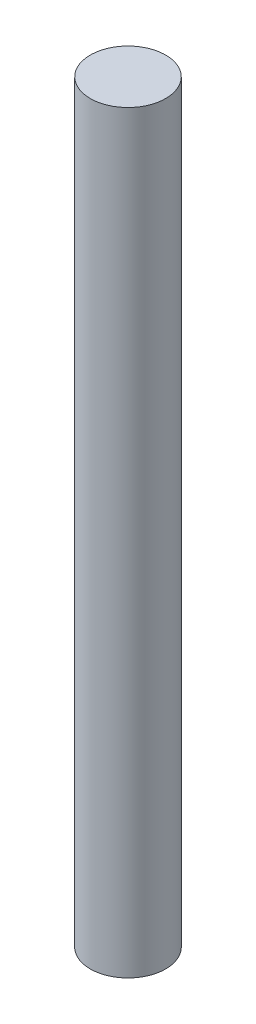
ISO-10303-21;
HEADER;
FILE_DESCRIPTION(('STEP AP214'),'2;1');
FILE_NAME('part.step','',(''),(''),'','','');
FILE_SCHEMA(('AUTOMOTIVE_DESIGN { 1 0 10303 214 1 1 1 1 }'));
ENDSEC;
DATA;
#1=APPLICATION_CONTEXT('core data for automotive mechanical design processes');
#2=APPLICATION_PROTOCOL_DEFINITION('international standard','automotive_design',2000,#1);
#3=PRODUCT_CONTEXT('',#1,'mechanical');
#4=PRODUCT('Part','Part','',(#3));
#5=PRODUCT_RELATED_PRODUCT_CATEGORY('part','',(#4));
#6=PRODUCT_DEFINITION_FORMATION('','',#4);
#7=PRODUCT_DEFINITION_CONTEXT('part definition',#1,'design');
#8=PRODUCT_DEFINITION('design','',#6,#7);
#9=PRODUCT_DEFINITION_SHAPE('','',#8);
#10=(LENGTH_UNIT() NAMED_UNIT(*) SI_UNIT(.MILLI.,.METRE.));
#11=(NAMED_UNIT(*) PLANE_ANGLE_UNIT() SI_UNIT($,.RADIAN.));
#12=(NAMED_UNIT(*) SI_UNIT($,.STERADIAN.) SOLID_ANGLE_UNIT());
#13=UNCERTAINTY_MEASURE_WITH_UNIT(LENGTH_MEASURE(1.E-05),#10,'distance_accuracy_value','');
#14=(GEOMETRIC_REPRESENTATION_CONTEXT(3) GLOBAL_UNCERTAINTY_ASSIGNED_CONTEXT((#13)) GLOBAL_UNIT_ASSIGNED_CONTEXT((#10,
#11,#12)) REPRESENTATION_CONTEXT('',''));
#15=CARTESIAN_POINT('',(0.,0.,0.));
#16=DIRECTION('',(0.,0.,1.));
#17=DIRECTION('',(1.,0.,0.));
#18=AXIS2_PLACEMENT_3D('',#15,#16,#17);
#19=CARTESIAN_POINT('',(0.,45.72,0.));
#20=DIRECTION('',(0.,-1.,0.));
#21=DIRECTION('',(0.,0.,-1.));
#22=AXIS2_PLACEMENT_3D('',#19,#20,#21);
#23=CYLINDRICAL_SURFACE('',#22,2.286);
#24=CARTESIAN_POINT('',(0.,45.72,0.));
#25=DIRECTION('',(0.,1.,0.));
#26=DIRECTION('',(0.,0.,1.));
#27=AXIS2_PLACEMENT_3D('',#24,#25,#26);
#28=CIRCLE('',#27,2.286);
#29=CARTESIAN_POINT('',(0.,45.72,2.286));
#30=VERTEX_POINT('',#29);
#31=EDGE_CURVE('E10',#30,#30,#28,.T.);
#32=ORIENTED_EDGE('',*,*,#31,.F.);
#33=EDGE_LOOP('',(#32));
#34=FACE_BOUND('',#33,.T.);
#35=CARTESIAN_POINT('',(0.,0.,0.));
#36=DIRECTION('',(0.,1.,0.));
#37=DIRECTION('',(0.,0.,1.));
#38=AXIS2_PLACEMENT_3D('',#35,#36,#37);
#39=CIRCLE('',#38,2.286);
#40=CARTESIAN_POINT('',(0.,0.,2.286));
#41=VERTEX_POINT('',#40);
#42=EDGE_CURVE('E36',#41,#41,#39,.T.);
#43=ORIENTED_EDGE('',*,*,#42,.T.);
#44=EDGE_LOOP('',(#43));
#45=FACE_BOUND('',#44,.T.);
#46=ADVANCED_FACE('F33',(#34,#45),#23,.T.);
#47=CARTESIAN_POINT('',(0.,45.72,0.));
#48=DIRECTION('',(0.,1.,0.));
#49=DIRECTION('',(0.,0.,1.));
#50=AXIS2_PLACEMENT_3D('',#47,#48,#49);
#51=PLANE('',#50);
#52=ORIENTED_EDGE('',*,*,#31,.T.);
#53=EDGE_LOOP('',(#52));
#54=FACE_BOUND('',#53,.T.);
#55=ADVANCED_FACE('F48',(#54),#51,.T.);
#56=CARTESIAN_POINT('',(0.,0.,0.));
#57=DIRECTION('',(0.,1.,0.));
#58=DIRECTION('',(0.,0.,1.));
#59=AXIS2_PLACEMENT_3D('',#56,#57,#58);
#60=PLANE('',#59);
#61=ORIENTED_EDGE('',*,*,#42,.F.);
#62=EDGE_LOOP('',(#61));
#63=FACE_BOUND('',#62,.T.);
#64=ADVANCED_FACE('F46',(#63),#60,.F.);
#65=CLOSED_SHELL('',(#46,#55,#64));
#66=MANIFOLD_SOLID_BREP('B2',#65);
#67=ADVANCED_BREP_SHAPE_REPRESENTATION('',(#18,#66),#14);
#68=SHAPE_DEFINITION_REPRESENTATION(#9,#67);
ENDSEC;
END-ISO-10303-21;
